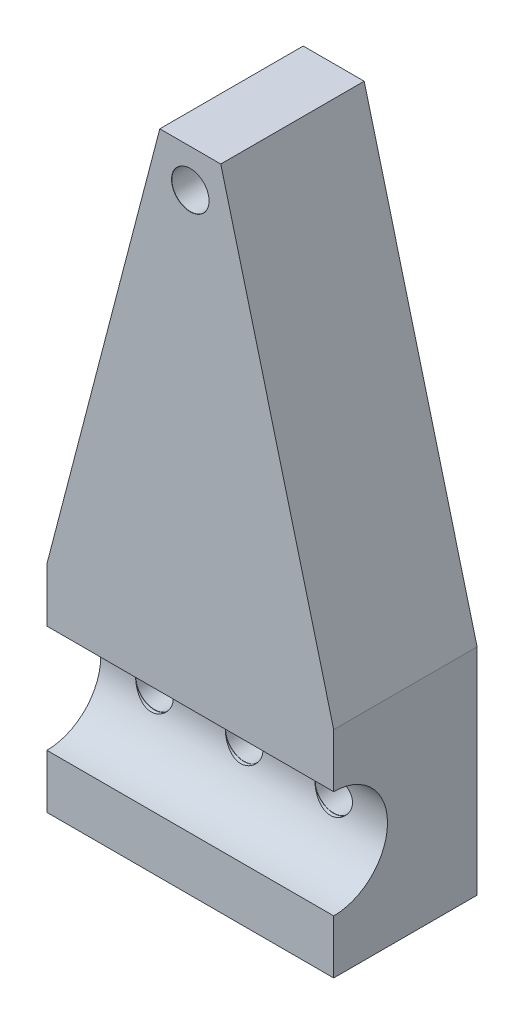
ISO-10303-21;
HEADER;
FILE_DESCRIPTION(('STEP AP214'),'2;1');
FILE_NAME('part.step','',(''),(''),'','','');
FILE_SCHEMA(('AUTOMOTIVE_DESIGN { 1 0 10303 214 1 1 1 1 }'));
ENDSEC;
DATA;
#1=APPLICATION_CONTEXT('core data for automotive mechanical design processes');
#2=APPLICATION_PROTOCOL_DEFINITION('international standard','automotive_design',2000,#1);
#3=PRODUCT_CONTEXT('',#1,'mechanical');
#4=PRODUCT('Part','Part','',(#3));
#5=PRODUCT_RELATED_PRODUCT_CATEGORY('part','',(#4));
#6=PRODUCT_DEFINITION_FORMATION('','',#4);
#7=PRODUCT_DEFINITION_CONTEXT('part definition',#1,'design');
#8=PRODUCT_DEFINITION('design','',#6,#7);
#9=PRODUCT_DEFINITION_SHAPE('','',#8);
#10=(LENGTH_UNIT() NAMED_UNIT(*) SI_UNIT(.MILLI.,.METRE.));
#11=(NAMED_UNIT(*) PLANE_ANGLE_UNIT() SI_UNIT($,.RADIAN.));
#12=(NAMED_UNIT(*) SI_UNIT($,.STERADIAN.) SOLID_ANGLE_UNIT());
#13=UNCERTAINTY_MEASURE_WITH_UNIT(LENGTH_MEASURE(1.E-05),#10,'distance_accuracy_value','');
#14=(GEOMETRIC_REPRESENTATION_CONTEXT(3) GLOBAL_UNCERTAINTY_ASSIGNED_CONTEXT((#13)) GLOBAL_UNIT_ASSIGNED_CONTEXT((#10,
#11,#12)) REPRESENTATION_CONTEXT('',''));
#15=CARTESIAN_POINT('',(0.,0.,0.));
#16=DIRECTION('',(0.,0.,1.));
#17=DIRECTION('',(1.,0.,0.));
#18=AXIS2_PLACEMENT_3D('',#15,#16,#17);
#19=CARTESIAN_POINT('',(-25.4,0.,25.4));
#20=DIRECTION('',(-1.,0.,0.));
#21=DIRECTION('',(0.,0.,1.));
#22=AXIS2_PLACEMENT_3D('',#19,#20,#21);
#23=PLANE('',#22);
#24=DIRECTION('',(0.,1.,0.));
#25=VECTOR('',#24,1.);
#26=CARTESIAN_POINT('',(-25.4,0.,25.4));
#27=LINE('',#26,#25);
#28=CARTESIAN_POINT('',(-25.4,-19.05,25.4));
#29=VERTEX_POINT('',#28);
#30=CARTESIAN_POINT('',(-25.4,-9.52500000000001,25.4));
#31=VERTEX_POINT('',#30);
#32=EDGE_CURVE('E246',#29,#31,#27,.T.);
#33=ORIENTED_EDGE('',*,*,#32,.T.);
#34=CARTESIAN_POINT('',(-25.4,0.,25.4));
#35=DIRECTION('',(-1.,0.,0.));
#36=DIRECTION('',(0.,0.,1.));
#37=AXIS2_PLACEMENT_3D('',#34,#35,#36);
#38=CIRCLE('',#37,9.525);
#39=CARTESIAN_POINT('',(-25.4,9.52499999999999,25.4));
#40=VERTEX_POINT('',#39);
#41=EDGE_CURVE('E237',#31,#40,#38,.F.);
#42=ORIENTED_EDGE('',*,*,#41,.T.);
#43=CARTESIAN_POINT('',(-25.4,19.05,25.4));
#44=VERTEX_POINT('',#43);
#45=EDGE_CURVE('E244',#40,#44,#27,.T.);
#46=ORIENTED_EDGE('',*,*,#45,.T.);
#47=DIRECTION('',(0.,0.,-1.));
#48=VECTOR('',#47,1.);
#49=CARTESIAN_POINT('',(-25.4,19.05,25.4));
#50=LINE('',#49,#48);
#51=CARTESIAN_POINT('',(-25.4,19.05,0.));
#52=VERTEX_POINT('',#51);
#53=EDGE_CURVE('E231',#44,#52,#50,.T.);
#54=ORIENTED_EDGE('',*,*,#53,.T.);
#55=DIRECTION('',(0.,1.,0.));
#56=VECTOR('',#55,1.);
#57=CARTESIAN_POINT('',(-25.4,0.,0.));
#58=LINE('',#57,#56);
#59=CARTESIAN_POINT('',(-25.4,-19.05,0.));
#60=VERTEX_POINT('',#59);
#61=EDGE_CURVE('E212',#60,#52,#58,.T.);
#62=ORIENTED_EDGE('',*,*,#61,.F.);
#63=DIRECTION('',(0.,0.,-1.));
#64=VECTOR('',#63,1.);
#65=CARTESIAN_POINT('',(-25.4,-19.05,25.4));
#66=LINE('',#65,#64);
#67=EDGE_CURVE('E229',#29,#60,#66,.T.);
#68=ORIENTED_EDGE('',*,*,#67,.F.);
#69=EDGE_LOOP('',(#33,#42,#46,#54,#62,#68));
#70=FACE_BOUND('',#69,.T.);
#71=ADVANCED_FACE('F47',(#70),#23,.T.);
#72=CARTESIAN_POINT('',(25.4,0.,25.4));
#73=DIRECTION('',(-1.,0.,0.));
#74=DIRECTION('',(0.,0.,1.));
#75=AXIS2_PLACEMENT_3D('',#72,#73,#74);
#76=PLANE('',#75);
#77=CARTESIAN_POINT('',(25.4,0.,25.4));
#78=DIRECTION('',(-1.,0.,0.));
#79=DIRECTION('',(0.,0.,1.));
#80=AXIS2_PLACEMENT_3D('',#77,#78,#79);
#81=CIRCLE('',#80,9.525);
#82=CARTESIAN_POINT('',(25.4,-9.525,25.4));
#83=VERTEX_POINT('',#82);
#84=CARTESIAN_POINT('',(25.4,9.52499999999999,25.4));
#85=VERTEX_POINT('',#84);
#86=EDGE_CURVE('E240',#83,#85,#81,.F.);
#87=ORIENTED_EDGE('',*,*,#86,.F.);
#88=DIRECTION('',(0.,1.,0.));
#89=VECTOR('',#88,1.);
#90=CARTESIAN_POINT('',(25.4,0.,25.4));
#91=LINE('',#90,#89);
#92=CARTESIAN_POINT('',(25.4,-19.05,25.4));
#93=VERTEX_POINT('',#92);
#94=EDGE_CURVE('E227',#93,#83,#91,.T.);
#95=ORIENTED_EDGE('',*,*,#94,.F.);
#96=DIRECTION('',(0.,0.,-1.));
#97=VECTOR('',#96,1.);
#98=CARTESIAN_POINT('',(25.4,-19.05,25.4));
#99=LINE('',#98,#97);
#100=CARTESIAN_POINT('',(25.4,-19.05,0.));
#101=VERTEX_POINT('',#100);
#102=EDGE_CURVE('E226',#93,#101,#99,.T.);
#103=ORIENTED_EDGE('',*,*,#102,.T.);
#104=DIRECTION('',(0.,1.,0.));
#105=VECTOR('',#104,1.);
#106=CARTESIAN_POINT('',(25.4,0.,0.));
#107=LINE('',#106,#105);
#108=CARTESIAN_POINT('',(25.4,19.05,0.));
#109=VERTEX_POINT('',#108);
#110=EDGE_CURVE('E220',#101,#109,#107,.T.);
#111=ORIENTED_EDGE('',*,*,#110,.T.);
#112=DIRECTION('',(0.,0.,-1.));
#113=VECTOR('',#112,1.);
#114=CARTESIAN_POINT('',(25.4,19.05,25.4));
#115=LINE('',#114,#113);
#116=CARTESIAN_POINT('',(25.4,19.05,25.4));
#117=VERTEX_POINT('',#116);
#118=EDGE_CURVE('E224',#117,#109,#115,.T.);
#119=ORIENTED_EDGE('',*,*,#118,.F.);
#120=EDGE_CURVE('E261',#85,#117,#91,.T.);
#121=ORIENTED_EDGE('',*,*,#120,.F.);
#122=EDGE_LOOP('',(#87,#95,#103,#111,#119,#121));
#123=FACE_BOUND('',#122,.T.);
#124=ADVANCED_FACE('F169',(#123),#76,.F.);
#125=CARTESIAN_POINT('',(0.,0.,25.4));
#126=DIRECTION('',(0.,0.,1.));
#127=DIRECTION('',(1.,0.,0.));
#128=AXIS2_PLACEMENT_3D('',#125,#126,#127);
#129=PLANE('',#128);
#130=DIRECTION('',(1.,0.,0.));
#131=VECTOR('',#130,1.);
#132=CARTESIAN_POINT('',(-30.4,-9.52500000000001,25.4));
#133=LINE('',#132,#131);
#134=EDGE_CURVE('E12',#31,#83,#133,.T.);
#135=ORIENTED_EDGE('',*,*,#134,.F.);
#136=ORIENTED_EDGE('',*,*,#32,.F.);
#137=DIRECTION('',(-1.,0.,0.));
#138=VECTOR('',#137,1.);
#139=CARTESIAN_POINT('',(0.,-19.05,25.4));
#140=LINE('',#139,#138);
#141=EDGE_CURVE('E254',#93,#29,#140,.T.);
#142=ORIENTED_EDGE('',*,*,#141,.F.);
#143=ORIENTED_EDGE('',*,*,#94,.T.);
#144=EDGE_LOOP('',(#135,#136,#142,#143));
#145=FACE_BOUND('',#144,.T.);
#146=ADVANCED_FACE('F176',(#145),#129,.T.);
#147=CARTESIAN_POINT('',(28.4333962760668,7.40937559565797,25.4));
#148=DIRECTION('',(0.96768400620087,0.252165945644995,0.));
#149=DIRECTION('',(-0.252165945644995,0.96768400620087,0.));
#150=AXIS2_PLACEMENT_3D('',#147,#148,#149);
#151=PLANE('',#150);
#152=DIRECTION('',(0.252165945644995,-0.96768400620087,0.));
#153=VECTOR('',#152,1.);
#154=CARTESIAN_POINT('',(28.4333962760668,7.40937559565797,0.));
#155=LINE('',#154,#153);
#156=CARTESIAN_POINT('',(5.39965378389645,95.8011057145303,0.));
#157=VERTEX_POINT('',#156);
#158=EDGE_CURVE('E205',#157,#109,#155,.T.);
#159=ORIENTED_EDGE('',*,*,#158,.F.);
#160=DIRECTION('',(0.,0.,-1.));
#161=VECTOR('',#160,1.);
#162=CARTESIAN_POINT('',(5.39965378389645,95.8011057145303,25.4));
#163=LINE('',#162,#161);
#164=CARTESIAN_POINT('',(5.39965378389645,95.8011057145303,25.4));
#165=VERTEX_POINT('',#164);
#166=EDGE_CURVE('E200',#165,#157,#163,.T.);
#167=ORIENTED_EDGE('',*,*,#166,.F.);
#168=DIRECTION('',(0.252165945644995,-0.96768400620087,0.));
#169=VECTOR('',#168,1.);
#170=CARTESIAN_POINT('',(28.4333962760668,7.40937559565797,25.4));
#171=LINE('',#170,#169);
#172=EDGE_CURVE('E223',#165,#117,#171,.T.);
#173=ORIENTED_EDGE('',*,*,#172,.T.);
#174=ORIENTED_EDGE('',*,*,#118,.T.);
#175=EDGE_LOOP('',(#159,#167,#173,#174));
#176=FACE_BOUND('',#175,.T.);
#177=ADVANCED_FACE('F49',(#176),#151,.T.);
#178=CARTESIAN_POINT('',(0.,95.8011057145303,25.4));
#179=DIRECTION('',(0.,1.,0.));
#180=DIRECTION('',(0.,0.,1.));
#181=AXIS2_PLACEMENT_3D('',#178,#179,#180);
#182=PLANE('',#181);
#183=DIRECTION('',(1.,0.,0.));
#184=VECTOR('',#183,1.);
#185=CARTESIAN_POINT('',(0.,95.8011057145303,0.));
#186=LINE('',#185,#184);
#187=CARTESIAN_POINT('',(-5.39965378389645,95.8011057145303,0.));
#188=VERTEX_POINT('',#187);
#189=EDGE_CURVE('E195',#188,#157,#186,.T.);
#190=ORIENTED_EDGE('',*,*,#189,.F.);
#191=DIRECTION('',(0.,0.,-1.));
#192=VECTOR('',#191,1.);
#193=CARTESIAN_POINT('',(-5.39965378389645,95.8011057145303,25.4));
#194=LINE('',#193,#192);
#195=CARTESIAN_POINT('',(-5.39965378389645,95.8011057145303,25.4));
#196=VERTEX_POINT('',#195);
#197=EDGE_CURVE('E198',#196,#188,#194,.T.);
#198=ORIENTED_EDGE('',*,*,#197,.F.);
#199=DIRECTION('',(1.,0.,0.));
#200=VECTOR('',#199,1.);
#201=CARTESIAN_POINT('',(0.,95.8011057145303,25.4));
#202=LINE('',#201,#200);
#203=EDGE_CURVE('E255',#196,#165,#202,.T.);
#204=ORIENTED_EDGE('',*,*,#203,.T.);
#205=ORIENTED_EDGE('',*,*,#166,.T.);
#206=EDGE_LOOP('',(#190,#198,#204,#205));
#207=FACE_BOUND('',#206,.T.);
#208=ADVANCED_FACE('F185',(#207),#182,.T.);
#209=CARTESIAN_POINT('',(-28.4333962760668,7.40937559565796,25.4));
#210=DIRECTION('',(-0.96768400620087,0.252165945644995,0.));
#211=DIRECTION('',(-0.252165945644995,-0.96768400620087,0.));
#212=AXIS2_PLACEMENT_3D('',#209,#210,#211);
#213=PLANE('',#212);
#214=DIRECTION('',(0.252165945644995,0.96768400620087,0.));
#215=VECTOR('',#214,1.);
#216=CARTESIAN_POINT('',(-28.4333962760668,7.40937559565796,0.));
#217=LINE('',#216,#215);
#218=EDGE_CURVE('E204',#52,#188,#217,.T.);
#219=ORIENTED_EDGE('',*,*,#218,.F.);
#220=ORIENTED_EDGE('',*,*,#53,.F.);
#221=DIRECTION('',(0.252165945644995,0.96768400620087,0.));
#222=VECTOR('',#221,1.);
#223=CARTESIAN_POINT('',(-28.4333962760668,7.40937559565796,25.4));
#224=LINE('',#223,#222);
#225=EDGE_CURVE('E252',#44,#196,#224,.T.);
#226=ORIENTED_EDGE('',*,*,#225,.T.);
#227=ORIENTED_EDGE('',*,*,#197,.T.);
#228=EDGE_LOOP('',(#219,#220,#226,#227));
#229=FACE_BOUND('',#228,.T.);
#230=ADVANCED_FACE('F183',(#229),#213,.T.);
#231=CARTESIAN_POINT('',(0.,-19.05,25.4));
#232=DIRECTION('',(0.,-1.,0.));
#233=DIRECTION('',(1.,0.,0.));
#234=AXIS2_PLACEMENT_3D('',#231,#232,#233);
#235=PLANE('',#234);
#236=DIRECTION('',(-1.,0.,0.));
#237=VECTOR('',#236,1.);
#238=CARTESIAN_POINT('',(0.,-19.05,0.));
#239=LINE('',#238,#237);
#240=EDGE_CURVE('E215',#101,#60,#239,.T.);
#241=ORIENTED_EDGE('',*,*,#240,.F.);
#242=ORIENTED_EDGE('',*,*,#102,.F.);
#243=ORIENTED_EDGE('',*,*,#141,.T.);
#244=ORIENTED_EDGE('',*,*,#67,.T.);
#245=EDGE_LOOP('',(#241,#242,#243,#244));
#246=FACE_BOUND('',#245,.T.);
#247=ADVANCED_FACE('F182',(#246),#235,.T.);
#248=CARTESIAN_POINT('',(0.,89.0924449527195,25.4));
#249=DIRECTION('',(0.,0.,1.));
#250=DIRECTION('',(1.,0.,0.));
#251=AXIS2_PLACEMENT_3D('',#248,#249,#250);
#252=CIRCLE('',#251,3.325);
#253=CARTESIAN_POINT('',(3.325,89.0924449527195,25.4));
#254=VERTEX_POINT('',#253);
#255=EDGE_CURVE('E289',#254,#254,#252,.T.);
#256=ORIENTED_EDGE('',*,*,#255,.F.);
#257=EDGE_LOOP('',(#256));
#258=FACE_BOUND('',#257,.T.);
#259=DIRECTION('',(1.,0.,0.));
#260=VECTOR('',#259,1.);
#261=CARTESIAN_POINT('',(-30.4,9.52499999999999,25.4));
#262=LINE('',#261,#260);
#263=EDGE_CURVE('E55',#85,#40,#262,.F.);
#264=ORIENTED_EDGE('',*,*,#263,.F.);
#265=ORIENTED_EDGE('',*,*,#120,.T.);
#266=ORIENTED_EDGE('',*,*,#172,.F.);
#267=ORIENTED_EDGE('',*,*,#203,.F.);
#268=ORIENTED_EDGE('',*,*,#225,.F.);
#269=ORIENTED_EDGE('',*,*,#45,.F.);
#270=EDGE_LOOP('',(#264,#265,#266,#267,#268,#269));
#271=FACE_BOUND('',#270,.T.);
#272=ADVANCED_FACE('F250',(#258,#271),#129,.T.);
#273=CARTESIAN_POINT('',(0.,0.,0.));
#274=DIRECTION('',(0.,0.,1.));
#275=DIRECTION('',(1.,0.,0.));
#276=AXIS2_PLACEMENT_3D('',#273,#274,#275);
#277=PLANE('',#276);
#278=CARTESIAN_POINT('',(0.,0.,0.));
#279=DIRECTION('',(0.,0.,1.));
#280=DIRECTION('',(0.,-1.,0.));
#281=AXIS2_PLACEMENT_3D('',#278,#279,#280);
#282=CIRCLE('',#281,3.3);
#283=CARTESIAN_POINT('',(0.,-3.29999999999998,0.));
#284=VERTEX_POINT('',#283);
#285=EDGE_CURVE('E132',#284,#284,#282,.T.);
#286=ORIENTED_EDGE('',*,*,#285,.T.);
#287=EDGE_LOOP('',(#286));
#288=FACE_BOUND('',#287,.T.);
#289=CARTESIAN_POINT('',(-15.875,0.,0.));
#290=DIRECTION('',(0.,0.,1.));
#291=DIRECTION('',(0.,-1.,0.));
#292=AXIS2_PLACEMENT_3D('',#289,#290,#291);
#293=CIRCLE('',#292,3.3);
#294=CARTESIAN_POINT('',(-15.875,-3.29999999999998,0.));
#295=VERTEX_POINT('',#294);
#296=EDGE_CURVE('E473',#295,#295,#293,.T.);
#297=ORIENTED_EDGE('',*,*,#296,.T.);
#298=EDGE_LOOP('',(#297));
#299=FACE_BOUND('',#298,.T.);
#300=CARTESIAN_POINT('',(15.875,0.,0.));
#301=DIRECTION('',(0.,0.,1.));
#302=DIRECTION('',(0.,-1.,0.));
#303=AXIS2_PLACEMENT_3D('',#300,#301,#302);
#304=CIRCLE('',#303,3.29999999999999);
#305=CARTESIAN_POINT('',(15.875,-3.29999999999998,0.));
#306=VERTEX_POINT('',#305);
#307=EDGE_CURVE('E459',#306,#306,#304,.T.);
#308=ORIENTED_EDGE('',*,*,#307,.T.);
#309=EDGE_LOOP('',(#308));
#310=FACE_BOUND('',#309,.T.);
#311=CARTESIAN_POINT('',(0.,89.0924449527195,0.));
#312=DIRECTION('',(0.,0.,1.));
#313=DIRECTION('',(1.,0.,0.));
#314=AXIS2_PLACEMENT_3D('',#311,#312,#313);
#315=CIRCLE('',#314,3.3);
#316=CARTESIAN_POINT('',(3.3,89.0924449527195,0.));
#317=VERTEX_POINT('',#316);
#318=EDGE_CURVE('E247',#317,#317,#315,.T.);
#319=ORIENTED_EDGE('',*,*,#318,.T.);
#320=EDGE_LOOP('',(#319));
#321=FACE_BOUND('',#320,.T.);
#322=ORIENTED_EDGE('',*,*,#158,.T.);
#323=ORIENTED_EDGE('',*,*,#110,.F.);
#324=ORIENTED_EDGE('',*,*,#240,.T.);
#325=ORIENTED_EDGE('',*,*,#61,.T.);
#326=ORIENTED_EDGE('',*,*,#218,.T.);
#327=ORIENTED_EDGE('',*,*,#189,.T.);
#328=EDGE_LOOP('',(#322,#323,#324,#325,#326,#327));
#329=FACE_BOUND('',#328,.T.);
#330=ADVANCED_FACE('F209',(#288,#299,#310,#321,#329),#277,.F.);
#331=CARTESIAN_POINT('',(-30.4,0.,25.4));
#332=DIRECTION('',(1.,0.,0.));
#333=DIRECTION('',(0.,1.,0.));
#334=AXIS2_PLACEMENT_3D('',#331,#332,#333);
#335=CYLINDRICAL_SURFACE('',#334,9.525);
#336=CARTESIAN_POINT('',(3.325,0.,15.875));
#337=CARTESIAN_POINT('',(3.32500269177788,-0.180927886540019,15.8749981181154));
#338=CARTESIAN_POINT('',(3.31018494433519,-0.361836565163814,15.8802016899135));
#339=CARTESIAN_POINT('',(3.25150794893367,-0.718296007582611,15.9004446505123));
#340=CARTESIAN_POINT('',(3.20764841204943,-0.893846718055107,15.9154841371666));
#341=CARTESIAN_POINT('',(3.092594954062,-1.2343998782923,15.953771915604));
#342=CARTESIAN_POINT('',(3.02144934443458,-1.3994203734488,15.9770056931368));
#343=CARTESIAN_POINT('',(2.85407172098198,-1.71518268607094,16.0293318697378));
#344=CARTESIAN_POINT('',(2.75783404494306,-1.86592127023493,16.0584255908089));
#345=CARTESIAN_POINT('',(2.5392164390047,-2.15450066147796,16.1206524959264));
#346=CARTESIAN_POINT('',(2.4160618906127,-2.2917321891639,16.1538890768646));
#347=CARTESIAN_POINT('',(2.1487520813847,-2.54406902747633,16.2201095497923));
#348=CARTESIAN_POINT('',(2.00459159181076,-2.65916881253863,16.2530933767091));
#349=CARTESIAN_POINT('',(1.69370720388528,-2.8675951528428,16.3162348340098));
#350=CARTESIAN_POINT('',(1.52640784596148,-2.96010480396657,16.3462678611302));
#351=CARTESIAN_POINT('',(1.1774086521571,-3.1154096899305,16.3985217094727));
#352=CARTESIAN_POINT('',(0.995713724465665,-3.17821500203773,16.4207451794471));
#353=CARTESIAN_POINT('',(0.630045097814761,-3.26999852034723,16.453768946574));
#354=CARTESIAN_POINT('',(0.446396080838094,-3.30012669649354,16.4649562313877));
#355=CARTESIAN_POINT('',(0.0763348618301902,-3.32929653477738,16.4757815328895));
#356=CARTESIAN_POINT('',(-0.110076363913892,-3.32834893031762,16.4754235372544));
#357=CARTESIAN_POINT('',(-0.470313085663508,-3.2962819343437,16.4635358816454));
#358=CARTESIAN_POINT('',(-0.644297180541109,-3.26669626446035,16.4525741289399));
#359=CARTESIAN_POINT('',(-0.984656041030218,-3.18070719773596,16.4216486608529));
#360=CARTESIAN_POINT('',(-1.15102980909656,-3.12430029620521,16.4016837690625));
#361=CARTESIAN_POINT('',(-1.47479736181408,-2.98532662091524,16.3546203951965));
#362=CARTESIAN_POINT('',(-1.63198740963477,-2.90232648413167,16.3274050949932));
#363=CARTESIAN_POINT('',(-1.93067883925261,-2.71282348818773,16.2689526656893));
#364=CARTESIAN_POINT('',(-2.07217532762189,-2.60631332912104,16.2377142886735));
#365=CARTESIAN_POINT('',(-2.34403637929452,-2.36557529407886,16.172536701332));
#366=CARTESIAN_POINT('',(-2.47328984467824,-2.23010400072464,16.1385455791034));
#367=CARTESIAN_POINT('',(-2.70754875444862,-1.93899799014072,16.0732568594393));
#368=CARTESIAN_POINT('',(-2.81255140110428,-1.78336094969019,16.0419595730432));
#369=CARTESIAN_POINT('',(-2.99633987901323,-1.45381167080781,15.9851020227686));
#370=CARTESIAN_POINT('',(-3.07480175744895,-1.27970546926015,15.9596138076835));
#371=CARTESIAN_POINT('',(-3.20096884767642,-0.919658833769965,15.9177728231044));
#372=CARTESIAN_POINT('',(-3.24868582407266,-0.733722956439573,15.9014165595691));
#373=CARTESIAN_POINT('',(-3.30997931578551,-0.364681311600993,15.8802742073924));
#374=CARTESIAN_POINT('',(-3.32505523155,-0.181853362837723,15.8749803819676));
#375=CARTESIAN_POINT('',(-3.32494449182676,0.183772843083712,15.8750197145331));
#376=CARTESIAN_POINT('',(-3.30976351159849,0.366571099379508,15.8803508796033));
#377=CARTESIAN_POINT('',(-3.25074062617003,0.720773821851788,15.9007056096004));
#378=CARTESIAN_POINT('',(-3.20784155757056,0.892355578023737,15.9154101246152));
#379=CARTESIAN_POINT('',(-3.09580178597797,1.22579942118642,15.9527141254993));
#380=CARTESIAN_POINT('',(-3.02665768938929,1.38766024808281,15.9753146323246));
#381=CARTESIAN_POINT('',(-2.86198984574268,1.70205719525428,16.0269151258067));
#382=CARTESIAN_POINT('',(-2.7657906094408,1.85421258808097,16.0560745406908));
#383=CARTESIAN_POINT('',(-2.55052487839132,2.14069537677284,16.1175138248302));
#384=CARTESIAN_POINT('',(-2.4314508238442,2.27501685389701,16.1497947239349));
#385=CARTESIAN_POINT('',(-2.16677873954134,2.52902979366398,16.2158981647271));
#386=CARTESIAN_POINT('',(-2.02015137751413,2.64765237903986,16.2497169916967));
#387=CARTESIAN_POINT('',(-1.70836279015576,2.85876951736255,16.3134571358643));
#388=CARTESIAN_POINT('',(-1.54320094563822,2.95126319705075,16.3433783227807));
#389=CARTESIAN_POINT('',(-1.19854986279588,3.10722692084172,16.3956915383019));
#390=CARTESIAN_POINT('',(-1.01906215516933,3.17070006088498,16.4180843699719));
#391=CARTESIAN_POINT('',(-0.650968379666502,3.26618568093222,16.4523589736492));
#392=CARTESIAN_POINT('',(-0.462367009063259,3.29821419012142,16.4642461007259));
#393=CARTESIAN_POINT('',(-0.0928034725757218,3.32857982042956,16.4755158448749));
#394=CARTESIAN_POINT('',(0.0879927086048065,3.32870839799607,16.4755633590752));
#395=CARTESIAN_POINT('',(0.446883839589189,3.29974595268097,16.4648147826168));
#396=CARTESIAN_POINT('',(0.624978980572901,3.2706570077084,16.4540194630852));
#397=CARTESIAN_POINT('',(0.969324999293775,3.18540298790269,16.4233191206398));
#398=CARTESIAN_POINT('',(1.13575362916829,3.12987254444573,16.4036281457709));
#399=CARTESIAN_POINT('',(1.45705082643739,2.99384079496226,16.3574518493609));
#400=CARTESIAN_POINT('',(1.61191667096609,2.91333363015078,16.3309649339498));
#401=CARTESIAN_POINT('',(1.91359361956794,2.7252250427327,16.272629544645));
#402=CARTESIAN_POINT('',(2.05968358482258,2.61652762683642,16.2405875277619));
#403=CARTESIAN_POINT('',(2.3321264701041,2.37691852297498,16.1755065886171));
#404=CARTESIAN_POINT('',(2.45847353565305,2.24600026965339,16.1424673741029));
#405=CARTESIAN_POINT('',(2.69351066055604,1.95871399341554,16.0773572976596));
#406=CARTESIAN_POINT('',(2.80117075906712,1.80147556719491,16.0453941459572));
#407=CARTESIAN_POINT('',(2.98844225240492,1.47005025149398,15.9876237089698));
#408=CARTESIAN_POINT('',(3.06805756187093,1.29586573177381,15.9618155646988));
#409=CARTESIAN_POINT('',(3.19562776113151,0.93768580378341,15.9195757741975));
#410=CARTESIAN_POINT('',(3.24397367903628,0.753843944646918,15.9030286847162));
#411=CARTESIAN_POINT('',(3.30865282194494,0.379992885961871,15.8807436640996));
#412=CARTESIAN_POINT('',(3.32499717346105,0.189985853327078,15.8750019760993));
#413=CARTESIAN_POINT('',(3.325,0.,15.875));
#414=B_SPLINE_CURVE_WITH_KNOTS('',3,(#336,#337,#338,#339,#340,#341,#342,#343,#344,#345,#346,
#347,#348,#349,#350,#351,#352,#353,#354,#355,#356,#357,#358,#359,#360,#361,#362,#363,#364,#365,
#366,#367,#368,#369,#370,#371,#372,#373,#374,#375,#376,#377,#378,#379,#380,#381,#382,#383,#384,
#385,#386,#387,#388,#389,#390,#391,#392,#393,#394,#395,#396,#397,#398,#399,#400,#401,#402,#403,
#404,#405,#406,#407,#408,#409,#410,#411,#412,#413),.UNSPECIFIED.,.T.,.F.,(4,2,2,2,2,2,2,2,2,2,2,
2,2,2,2,2,2,2,2,2,2,2,2,2,2,2,2,2,2,2,2,2,2,2,2,2,2,2,4),(0.,0.542083902588746,1.0841731982393,
1.62530709349149,2.1665632055265,2.72614013357338,3.28585658858578,3.86352810782444,
4.44100350981462,4.99742173500784,5.55364777844903,6.08164419569958,6.60970962440967,
7.14685997279776,7.68417734259077,8.25245296020779,8.82079410505654,9.39584115702675,
9.97066803508929,10.5184740649625,11.0661773530087,11.5961667181282,12.126224636522,
12.6709140821693,13.2157838505174,13.7879276383818,14.3600905456996,14.9321923998498,
15.5040024682427,16.0436927616874,16.5833446758364,17.1106512230214,17.6380815540472,
18.1903120104623,18.7427059135181,19.3195670489148,19.8963476310602,20.4657684164953,
21.034991186836),.UNSPECIFIED.);
#415=CARTESIAN_POINT('',(3.325,0.,15.875));
#416=VERTEX_POINT('',#415);
#417=CARTESIAN_POINT('',(-3.325,0.,15.875));
#418=VERTEX_POINT('',#417);
#419=EDGE_CURVE('E135',#416,#418,#414,.T.);
#420=ORIENTED_EDGE('',*,*,#419,.T.);
#421=EDGE_CURVE('E131',#418,#416,#414,.T.);
#422=ORIENTED_EDGE('',*,*,#421,.T.);
#423=EDGE_LOOP('',(#420,#422));
#424=FACE_BOUND('',#423,.T.);
#425=CARTESIAN_POINT('',(-12.55,0.,15.875));
#426=CARTESIAN_POINT('',(-12.5499973082221,-0.180927886540021,15.8749981181154));
#427=CARTESIAN_POINT('',(-12.5648150556648,-0.361836565163816,15.8802016899135));
#428=CARTESIAN_POINT('',(-12.6234920510663,-0.718296007582613,15.9004446505123));
#429=CARTESIAN_POINT('',(-12.6673515879506,-0.893846718055109,15.9154841371666));
#430=CARTESIAN_POINT('',(-12.782405045938,-1.2343998782923,15.953771915604));
#431=CARTESIAN_POINT('',(-12.8535506555654,-1.3994203734488,15.9770056931368));
#432=CARTESIAN_POINT('',(-13.020928279018,-1.71518268607094,16.0293318697378));
#433=CARTESIAN_POINT('',(-13.1171659550569,-1.86592127023494,16.0584255908089));
#434=CARTESIAN_POINT('',(-13.3357835609953,-2.15450066147796,16.1206524959264));
#435=CARTESIAN_POINT('',(-13.4589381093873,-2.2917321891639,16.1538890768646));
#436=CARTESIAN_POINT('',(-13.7262479186153,-2.54406902747633,16.2201095497923));
#437=CARTESIAN_POINT('',(-13.8704084081892,-2.65916881253863,16.2530933767091));
#438=CARTESIAN_POINT('',(-14.1812927961147,-2.8675951528428,16.3162348340098));
#439=CARTESIAN_POINT('',(-14.3485921540385,-2.96010480396657,16.3462678611302));
#440=CARTESIAN_POINT('',(-14.6975913478429,-3.11540968993051,16.3985217094727));
#441=CARTESIAN_POINT('',(-14.8792862755343,-3.17821500203773,16.4207451794471));
#442=CARTESIAN_POINT('',(-15.2449549021852,-3.26999852034723,16.453768946574));
#443=CARTESIAN_POINT('',(-15.4286039191619,-3.30012669649354,16.4649562313877));
#444=CARTESIAN_POINT('',(-15.7986651381698,-3.32929653477738,16.4757815328895));
#445=CARTESIAN_POINT('',(-15.9850763639139,-3.32834893031762,16.4754235372544));
#446=CARTESIAN_POINT('',(-16.3453130856635,-3.2962819343437,16.4635358816454));
#447=CARTESIAN_POINT('',(-16.5192971805411,-3.26669626446035,16.4525741289399));
#448=CARTESIAN_POINT('',(-16.8596560410302,-3.18070719773596,16.4216486608529));
#449=CARTESIAN_POINT('',(-17.0260298090966,-3.12430029620521,16.4016837690625));
#450=CARTESIAN_POINT('',(-17.3497973618141,-2.98532662091524,16.3546203951965));
#451=CARTESIAN_POINT('',(-17.5069874096348,-2.90232648413167,16.3274050949932));
#452=CARTESIAN_POINT('',(-17.8056788392526,-2.71282348818773,16.2689526656893));
#453=CARTESIAN_POINT('',(-17.9471753276219,-2.60631332912104,16.2377142886735));
#454=CARTESIAN_POINT('',(-18.2190363792945,-2.36557529407886,16.172536701332));
#455=CARTESIAN_POINT('',(-18.3482898446782,-2.23010400072464,16.1385455791034));
#456=CARTESIAN_POINT('',(-18.5825487544486,-1.93899799014072,16.0732568594393));
#457=CARTESIAN_POINT('',(-18.6875514011043,-1.78336094969019,16.0419595730432));
#458=CARTESIAN_POINT('',(-18.8713398790132,-1.45381167080781,15.9851020227686));
#459=CARTESIAN_POINT('',(-18.949801757449,-1.27970546926014,15.9596138076835));
#460=CARTESIAN_POINT('',(-19.0759688476764,-0.919658833769962,15.9177728231044));
#461=CARTESIAN_POINT('',(-19.1236858240727,-0.73372295643957,15.9014165595691));
#462=CARTESIAN_POINT('',(-19.1849793157855,-0.364681311600989,15.8802742073924));
#463=CARTESIAN_POINT('',(-19.20005523155,-0.181853362837718,15.8749803819676));
#464=CARTESIAN_POINT('',(-19.1999444918268,0.183772843083717,15.8750197145331));
#465=CARTESIAN_POINT('',(-19.1847635115985,0.366571099379511,15.8803508796033));
#466=CARTESIAN_POINT('',(-19.12574062617,0.720773821851791,15.9007056096004));
#467=CARTESIAN_POINT('',(-19.0828415575706,0.892355578023739,15.9154101246152));
#468=CARTESIAN_POINT('',(-18.970801785978,1.22579942118643,15.9527141254993));
#469=CARTESIAN_POINT('',(-18.9016576893893,1.38766024808281,15.9753146323246));
#470=CARTESIAN_POINT('',(-18.7369898457427,1.70205719525428,16.0269151258067));
#471=CARTESIAN_POINT('',(-18.6407906094408,1.85421258808097,16.0560745406908));
#472=CARTESIAN_POINT('',(-18.4255248783913,2.14069537677284,16.1175138248302));
#473=CARTESIAN_POINT('',(-18.3064508238442,2.27501685389701,16.1497947239349));
#474=CARTESIAN_POINT('',(-18.0417787395413,2.52902979366398,16.2158981647271));
#475=CARTESIAN_POINT('',(-17.8951513775141,2.64765237903986,16.2497169916967));
#476=CARTESIAN_POINT('',(-17.5833627901558,2.85876951736255,16.3134571358643));
#477=CARTESIAN_POINT('',(-17.4182009456382,2.95126319705075,16.3433783227807));
#478=CARTESIAN_POINT('',(-17.0735498627959,3.10722692084172,16.3956915383019));
#479=CARTESIAN_POINT('',(-16.8940621551693,3.17070006088498,16.4180843699719));
#480=CARTESIAN_POINT('',(-16.5259683796665,3.26618568093222,16.4523589736492));
#481=CARTESIAN_POINT('',(-16.3373670090633,3.29821419012142,16.4642461007259));
#482=CARTESIAN_POINT('',(-15.9678034725757,3.32857982042956,16.4755158448749));
#483=CARTESIAN_POINT('',(-15.7870072913952,3.32870839799607,16.4755633590752));
#484=CARTESIAN_POINT('',(-15.4281161604108,3.29974595268097,16.4648147826168));
#485=CARTESIAN_POINT('',(-15.2500210194271,3.2706570077084,16.4540194630853));
#486=CARTESIAN_POINT('',(-14.9056750007062,3.18540298790269,16.4233191206398));
#487=CARTESIAN_POINT('',(-14.7392463708317,3.12987254444573,16.4036281457709));
#488=CARTESIAN_POINT('',(-14.4179491735626,2.99384079496226,16.3574518493609));
#489=CARTESIAN_POINT('',(-14.2630833290339,2.91333363015078,16.3309649339498));
#490=CARTESIAN_POINT('',(-13.9614063804321,2.7252250427327,16.272629544645));
#491=CARTESIAN_POINT('',(-13.8153164151774,2.61652762683642,16.2405875277619));
#492=CARTESIAN_POINT('',(-13.5428735298959,2.37691852297498,16.1755065886171));
#493=CARTESIAN_POINT('',(-13.416526464347,2.24600026965339,16.1424673741029));
#494=CARTESIAN_POINT('',(-13.181489339444,1.95871399341554,16.0773572976596));
#495=CARTESIAN_POINT('',(-13.0738292409329,1.80147556719491,16.0453941459572));
#496=CARTESIAN_POINT('',(-12.8865577475951,1.47005025149398,15.9876237089698));
#497=CARTESIAN_POINT('',(-12.8069424381291,1.29586573177381,15.9618155646988));
#498=CARTESIAN_POINT('',(-12.6793722388685,0.937685803783407,15.9195757741975));
#499=CARTESIAN_POINT('',(-12.6310263209637,0.753843944646915,15.9030286847162));
#500=CARTESIAN_POINT('',(-12.5663471780551,0.379992885961869,15.8807436640996));
#501=CARTESIAN_POINT('',(-12.5500028265389,0.189985853327076,15.8750019760993));
#502=CARTESIAN_POINT('',(-12.55,0.,15.875));
#503=B_SPLINE_CURVE_WITH_KNOTS('',3,(#425,#426,#427,#428,#429,#430,#431,#432,#433,#434,#435,
#436,#437,#438,#439,#440,#441,#442,#443,#444,#445,#446,#447,#448,#449,#450,#451,#452,#453,#454,
#455,#456,#457,#458,#459,#460,#461,#462,#463,#464,#465,#466,#467,#468,#469,#470,#471,#472,#473,
#474,#475,#476,#477,#478,#479,#480,#481,#482,#483,#484,#485,#486,#487,#488,#489,#490,#491,#492,
#493,#494,#495,#496,#497,#498,#499,#500,#501,#502),.UNSPECIFIED.,.T.,.F.,(4,2,2,2,2,2,2,2,2,2,2,
2,2,2,2,2,2,2,2,2,2,2,2,2,2,2,2,2,2,2,2,2,2,2,2,2,2,2,4),(0.,0.542083902588747,1.0841731982393,
1.62530709349149,2.1665632055265,2.72614013357339,3.28585658858578,3.86352810782444,
4.44100350981462,4.99742173500783,5.55364777844902,6.08164419569958,6.60970962440967,
7.14685997279776,7.68417734259077,8.25245296020779,8.82079410505654,9.39584115702675,
9.97066803508929,10.5184740649625,11.0661773530087,11.5961667181282,12.126224636522,
12.6709140821693,13.2157838505174,13.7879276383818,14.3600905456996,14.9321923998498,
15.5040024682427,16.0436927616874,16.5833446758364,17.1106512230214,17.6380815540472,
18.1903120104624,18.7427059135181,19.3195670489148,19.8963476310602,20.4657684164954,
21.034991186836),.UNSPECIFIED.);
#504=CARTESIAN_POINT('',(-12.55,0.,15.875));
#505=VERTEX_POINT('',#504);
#506=CARTESIAN_POINT('',(-19.2,0.,15.875));
#507=VERTEX_POINT('',#506);
#508=EDGE_CURVE('E444',#505,#507,#503,.T.);
#509=ORIENTED_EDGE('',*,*,#508,.T.);
#510=EDGE_CURVE('E452',#507,#505,#503,.T.);
#511=ORIENTED_EDGE('',*,*,#510,.T.);
#512=EDGE_LOOP('',(#509,#511));
#513=FACE_BOUND('',#512,.T.);
#514=CARTESIAN_POINT('',(19.2,0.,15.875));
#515=CARTESIAN_POINT('',(19.2000026917779,-0.180927886540017,15.8749981181154));
#516=CARTESIAN_POINT('',(19.1851849443352,-0.361836565163812,15.8802016899135));
#517=CARTESIAN_POINT('',(19.1265079489337,-0.71829600758261,15.9004446505123));
#518=CARTESIAN_POINT('',(19.0826484120494,-0.893846718055105,15.9154841371666));
#519=CARTESIAN_POINT('',(18.967594954062,-1.2343998782923,15.953771915604));
#520=CARTESIAN_POINT('',(18.8964493444346,-1.3994203734488,15.9770056931368));
#521=CARTESIAN_POINT('',(18.729071720982,-1.71518268607094,16.0293318697378));
#522=CARTESIAN_POINT('',(18.6328340449431,-1.86592127023493,16.0584255908089));
#523=CARTESIAN_POINT('',(18.4142164390047,-2.15450066147796,16.1206524959264));
#524=CARTESIAN_POINT('',(18.2910618906127,-2.2917321891639,16.1538890768646));
#525=CARTESIAN_POINT('',(18.0237520813847,-2.54406902747633,16.2201095497923));
#526=CARTESIAN_POINT('',(17.8795915918108,-2.65916881253863,16.2530933767091));
#527=CARTESIAN_POINT('',(17.5687072038853,-2.86759515284279,16.3162348340098));
#528=CARTESIAN_POINT('',(17.4014078459615,-2.96010480396656,16.3462678611302));
#529=CARTESIAN_POINT('',(17.0524086521571,-3.1154096899305,16.3985217094727));
#530=CARTESIAN_POINT('',(16.8707137244657,-3.17821500203773,16.4207451794471));
#531=CARTESIAN_POINT('',(16.5050450978148,-3.26999852034723,16.453768946574));
#532=CARTESIAN_POINT('',(16.3213960808381,-3.30012669649354,16.4649562313877));
#533=CARTESIAN_POINT('',(15.9513348618302,-3.32929653477738,16.4757815328895));
#534=CARTESIAN_POINT('',(15.7649236360861,-3.32834893031761,16.4754235372544));
#535=CARTESIAN_POINT('',(15.4046869143365,-3.29628193434369,16.4635358816454));
#536=CARTESIAN_POINT('',(15.2307028194589,-3.26669626446035,16.4525741289399));
#537=CARTESIAN_POINT('',(14.8903439589698,-3.18070719773596,16.4216486608529));
#538=CARTESIAN_POINT('',(14.7239701909034,-3.1243002962052,16.4016837690625));
#539=CARTESIAN_POINT('',(14.4002026381859,-2.98532662091523,16.3546203951965));
#540=CARTESIAN_POINT('',(14.2430125903652,-2.90232648413167,16.3274050949932));
#541=CARTESIAN_POINT('',(13.9443211607474,-2.71282348818772,16.2689526656893));
#542=CARTESIAN_POINT('',(13.8028246723781,-2.60631332912104,16.2377142886735));
#543=CARTESIAN_POINT('',(13.5309636207055,-2.36557529407885,16.172536701332));
#544=CARTESIAN_POINT('',(13.4017101553218,-2.23010400072463,16.1385455791034));
#545=CARTESIAN_POINT('',(13.1674512455514,-1.93899799014071,16.0732568594393));
#546=CARTESIAN_POINT('',(13.0624485988957,-1.78336094969019,16.0419595730432));
#547=CARTESIAN_POINT('',(12.8786601209868,-1.4538116708078,15.9851020227686));
#548=CARTESIAN_POINT('',(12.800198242551,-1.27970546926014,15.9596138076835));
#549=CARTESIAN_POINT('',(12.6740311523236,-0.919658833769955,15.9177728231044));
#550=CARTESIAN_POINT('',(12.6263141759273,-0.733722956439563,15.9014165595691));
#551=CARTESIAN_POINT('',(12.5650206842145,-0.364681311600983,15.8802742073924));
#552=CARTESIAN_POINT('',(12.54994476845,-0.181853362837713,15.8749803819676));
#553=CARTESIAN_POINT('',(12.5500555081732,0.183772843083722,15.8750197145331));
#554=CARTESIAN_POINT('',(12.5652364884015,0.366571099379517,15.8803508796033));
#555=CARTESIAN_POINT('',(12.62425937383,0.720773821851798,15.9007056096004));
#556=CARTESIAN_POINT('',(12.6671584424294,0.892355578023747,15.9154101246152));
#557=CARTESIAN_POINT('',(12.779198214022,1.22579942118643,15.9527141254993));
#558=CARTESIAN_POINT('',(12.8483423106107,1.38766024808282,15.9753146323246));
#559=CARTESIAN_POINT('',(13.0130101542573,1.70205719525429,16.0269151258067));
#560=CARTESIAN_POINT('',(13.1092093905592,1.85421258808098,16.0560745406908));
#561=CARTESIAN_POINT('',(13.3244751216087,2.14069537677285,16.1175138248302));
#562=CARTESIAN_POINT('',(13.4435491761558,2.27501685389702,16.1497947239349));
#563=CARTESIAN_POINT('',(13.7082212604587,2.52902979366399,16.2158981647271));
#564=CARTESIAN_POINT('',(13.8548486224859,2.64765237903987,16.2497169916967));
#565=CARTESIAN_POINT('',(14.1666372098442,2.85876951736256,16.3134571358643));
#566=CARTESIAN_POINT('',(14.3317990543618,2.95126319705076,16.3433783227807));
#567=CARTESIAN_POINT('',(14.6764501372041,3.10722692084173,16.3956915383019));
#568=CARTESIAN_POINT('',(14.8559378448307,3.17070006088499,16.4180843699719));
#569=CARTESIAN_POINT('',(15.2240316203335,3.26618568093223,16.4523589736492));
#570=CARTESIAN_POINT('',(15.4126329909367,3.29821419012143,16.4642461007259));
#571=CARTESIAN_POINT('',(15.7821965274243,3.32857982042957,16.4755158448749));
#572=CARTESIAN_POINT('',(15.9629927086048,3.32870839799607,16.4755633590752));
#573=CARTESIAN_POINT('',(16.3218838395892,3.29974595268098,16.4648147826168));
#574=CARTESIAN_POINT('',(16.4999789805729,3.27065700770841,16.4540194630853));
#575=CARTESIAN_POINT('',(16.8443249992938,3.1854029879027,16.4233191206398));
#576=CARTESIAN_POINT('',(17.0107536291683,3.12987254444573,16.4036281457709));
#577=CARTESIAN_POINT('',(17.3320508264374,2.99384079496227,16.3574518493609));
#578=CARTESIAN_POINT('',(17.4869166709661,2.91333363015079,16.3309649339498));
#579=CARTESIAN_POINT('',(17.7885936195679,2.7252250427327,16.272629544645));
#580=CARTESIAN_POINT('',(17.9346835848226,2.61652762683642,16.2405875277619));
#581=CARTESIAN_POINT('',(18.2071264701041,2.37691852297498,16.1755065886171));
#582=CARTESIAN_POINT('',(18.3334735356531,2.24600026965339,16.1424673741029));
#583=CARTESIAN_POINT('',(18.568510660556,1.95871399341555,16.0773572976596));
#584=CARTESIAN_POINT('',(18.6761707590671,1.80147556719492,16.0453941459572));
#585=CARTESIAN_POINT('',(18.8634422524049,1.47005025149399,15.9876237089698));
#586=CARTESIAN_POINT('',(18.9430575618709,1.29586573177381,15.9618155646988));
#587=CARTESIAN_POINT('',(19.0706277611315,0.937685803783412,15.9195757741975));
#588=CARTESIAN_POINT('',(19.1189736790363,0.753843944646919,15.9030286847162));
#589=CARTESIAN_POINT('',(19.1836528219449,0.379992885961873,15.8807436640996));
#590=CARTESIAN_POINT('',(19.1999971734611,0.18998585332708,15.8750019760993));
#591=CARTESIAN_POINT('',(19.2,0.,15.875));
#592=B_SPLINE_CURVE_WITH_KNOTS('',3,(#514,#515,#516,#517,#518,#519,#520,#521,#522,#523,#524,
#525,#526,#527,#528,#529,#530,#531,#532,#533,#534,#535,#536,#537,#538,#539,#540,#541,#542,#543,
#544,#545,#546,#547,#548,#549,#550,#551,#552,#553,#554,#555,#556,#557,#558,#559,#560,#561,#562,
#563,#564,#565,#566,#567,#568,#569,#570,#571,#572,#573,#574,#575,#576,#577,#578,#579,#580,#581,
#582,#583,#584,#585,#586,#587,#588,#589,#590,#591),.UNSPECIFIED.,.T.,.F.,(4,2,2,2,2,2,2,2,2,2,2,
2,2,2,2,2,2,2,2,2,2,2,2,2,2,2,2,2,2,2,2,2,2,2,2,2,2,2,4),(0.,0.542083902588747,1.0841731982393,
1.62530709349149,2.1665632055265,2.72614013357339,3.28585658858578,3.86352810782444,
4.44100350981462,4.99742173500784,5.55364777844903,6.08164419569959,6.60970962440967,
7.14685997279776,7.68417734259078,8.2524529602078,8.82079410505654,9.39584115702676,
9.9706680350893,10.5184740649625,11.0661773530087,11.5961667181283,12.126224636522,
12.6709140821693,13.2157838505175,13.7879276383819,14.3600905456996,14.9321923998498,
15.5040024682427,16.0436927616874,16.5833446758364,17.1106512230214,17.6380815540472,
18.1903120104624,18.7427059135182,19.3195670489148,19.8963476310602,20.4657684164954,
21.034991186836),.UNSPECIFIED.);
#593=CARTESIAN_POINT('',(19.2,0.,15.875));
#594=VERTEX_POINT('',#593);
#595=CARTESIAN_POINT('',(12.55,0.,15.875));
#596=VERTEX_POINT('',#595);
#597=EDGE_CURVE('E292',#594,#596,#592,.T.);
#598=ORIENTED_EDGE('',*,*,#597,.T.);
#599=EDGE_CURVE('E297',#596,#594,#592,.T.);
#600=ORIENTED_EDGE('',*,*,#599,.T.);
#601=EDGE_LOOP('',(#598,#600));
#602=FACE_BOUND('',#601,.T.);
#603=ORIENTED_EDGE('',*,*,#134,.T.);
#604=ORIENTED_EDGE('',*,*,#86,.T.);
#605=ORIENTED_EDGE('',*,*,#263,.T.);
#606=ORIENTED_EDGE('',*,*,#41,.F.);
#607=EDGE_LOOP('',(#603,#604,#605,#606));
#608=FACE_BOUND('',#607,.T.);
#609=ADVANCED_FACE('F144',(#424,#513,#602,#608),#335,.F.);
#610=CARTESIAN_POINT('',(0.,89.0924449527195,25.4));
#611=DIRECTION('',(0.,0.,1.));
#612=DIRECTION('',(1.,0.,0.));
#613=AXIS2_PLACEMENT_3D('',#610,#611,#612);
#614=CYLINDRICAL_SURFACE('',#613,3.29999999999999);
#615=ORIENTED_EDGE('',*,*,#318,.F.);
#616=EDGE_LOOP('',(#615));
#617=FACE_BOUND('',#616,.T.);
#618=CARTESIAN_POINT('',(0.,89.0924449527195,25.375));
#619=DIRECTION('',(0.,0.,1.));
#620=DIRECTION('',(1.,0.,0.));
#621=AXIS2_PLACEMENT_3D('',#618,#619,#620);
#622=CIRCLE('',#621,3.29999999999999);
#623=CARTESIAN_POINT('',(3.29999999999999,89.0924449527195,25.375));
#624=VERTEX_POINT('',#623);
#625=EDGE_CURVE('E291',#624,#624,#622,.T.);
#626=ORIENTED_EDGE('',*,*,#625,.T.);
#627=EDGE_LOOP('',(#626));
#628=FACE_BOUND('',#627,.T.);
#629=ADVANCED_FACE('F309',(#617,#628),#614,.F.);
#630=CARTESIAN_POINT('',(0.,89.0924449527195,25.4));
#631=DIRECTION('',(0.,0.,1.));
#632=DIRECTION('',(1.,0.,0.));
#633=AXIS2_PLACEMENT_3D('',#630,#631,#632);
#634=CONICAL_SURFACE('',#633,3.325,0.785398163397691);
#635=ORIENTED_EDGE('',*,*,#625,.F.);
#636=EDGE_LOOP('',(#635));
#637=FACE_BOUND('',#636,.T.);
#638=ORIENTED_EDGE('',*,*,#255,.T.);
#639=EDGE_LOOP('',(#638));
#640=FACE_BOUND('',#639,.T.);
#641=ADVANCED_FACE('F312',(#637,#640),#634,.F.);
#642=CARTESIAN_POINT('',(15.875,0.,15.875));
#643=DIRECTION('',(0.,0.,1.));
#644=DIRECTION('',(0.,-1.,0.));
#645=AXIS2_PLACEMENT_3D('',#642,#643,#644);
#646=CYLINDRICAL_SURFACE('',#645,3.325);
#647=CARTESIAN_POINT('',(15.875,0.,15.875));
#648=DIRECTION('',(0.,0.,1.));
#649=DIRECTION('',(0.,-1.,0.));
#650=AXIS2_PLACEMENT_3D('',#647,#648,#649);
#651=CIRCLE('',#650,3.325);
#652=EDGE_CURVE('E461',#596,#594,#651,.T.);
#653=ORIENTED_EDGE('',*,*,#652,.F.);
#654=ORIENTED_EDGE('',*,*,#597,.F.);
#655=EDGE_LOOP('',(#653,#654));
#656=FACE_BOUND('',#655,.T.);
#657=ADVANCED_FACE('F317',(#656),#646,.F.);
#658=CARTESIAN_POINT('',(15.875,0.,15.875));
#659=DIRECTION('',(0.,0.,1.));
#660=DIRECTION('',(0.,-1.,0.));
#661=AXIS2_PLACEMENT_3D('',#658,#659,#660);
#662=CIRCLE('',#661,3.325);
#663=EDGE_CURVE('E451',#594,#596,#662,.T.);
#664=ORIENTED_EDGE('',*,*,#663,.F.);
#665=ORIENTED_EDGE('',*,*,#599,.F.);
#666=EDGE_LOOP('',(#664,#665));
#667=FACE_BOUND('',#666,.T.);
#668=ADVANCED_FACE('F322',(#667),#646,.F.);
#669=CARTESIAN_POINT('',(15.875,0.,15.875));
#670=DIRECTION('',(0.,0.,1.));
#671=DIRECTION('',(0.,-1.,0.));
#672=AXIS2_PLACEMENT_3D('',#669,#670,#671);
#673=CYLINDRICAL_SURFACE('',#672,3.29999999999999);
#674=ORIENTED_EDGE('',*,*,#307,.F.);
#675=EDGE_LOOP('',(#674));
#676=FACE_BOUND('',#675,.T.);
#677=CARTESIAN_POINT('',(15.875,0.,15.85));
#678=DIRECTION('',(0.,0.,1.));
#679=DIRECTION('',(0.,-1.,0.));
#680=AXIS2_PLACEMENT_3D('',#677,#678,#679);
#681=CIRCLE('',#680,3.29999999999999);
#682=CARTESIAN_POINT('',(15.875,-3.29999999999998,15.85));
#683=VERTEX_POINT('',#682);
#684=EDGE_CURVE('E456',#683,#683,#681,.T.);
#685=ORIENTED_EDGE('',*,*,#684,.T.);
#686=EDGE_LOOP('',(#685));
#687=FACE_BOUND('',#686,.T.);
#688=ADVANCED_FACE('F356',(#676,#687),#673,.F.);
#689=CARTESIAN_POINT('',(15.875,0.,15.875));
#690=DIRECTION('',(0.,0.,1.));
#691=DIRECTION('',(0.,-1.,0.));
#692=AXIS2_PLACEMENT_3D('',#689,#690,#691);
#693=CONICAL_SURFACE('',#692,3.325,0.785398163397726);
#694=ORIENTED_EDGE('',*,*,#684,.F.);
#695=EDGE_LOOP('',(#694));
#696=FACE_BOUND('',#695,.T.);
#697=ORIENTED_EDGE('',*,*,#663,.T.);
#698=ORIENTED_EDGE('',*,*,#652,.T.);
#699=EDGE_LOOP('',(#697,#698));
#700=FACE_BOUND('',#699,.T.);
#701=ADVANCED_FACE('F365',(#696,#700),#693,.F.);
#702=CARTESIAN_POINT('',(-15.875,0.,15.875));
#703=DIRECTION('',(0.,0.,1.));
#704=DIRECTION('',(0.,-1.,0.));
#705=AXIS2_PLACEMENT_3D('',#702,#703,#704);
#706=CYLINDRICAL_SURFACE('',#705,3.325);
#707=CARTESIAN_POINT('',(-15.875,0.,15.875));
#708=DIRECTION('',(0.,0.,1.));
#709=DIRECTION('',(0.,-1.,0.));
#710=AXIS2_PLACEMENT_3D('',#707,#708,#709);
#711=CIRCLE('',#710,3.325);
#712=EDGE_CURVE('E453',#507,#505,#711,.T.);
#713=ORIENTED_EDGE('',*,*,#712,.F.);
#714=ORIENTED_EDGE('',*,*,#508,.F.);
#715=EDGE_LOOP('',(#713,#714));
#716=FACE_BOUND('',#715,.T.);
#717=ADVANCED_FACE('F375',(#716),#706,.F.);
#718=CARTESIAN_POINT('',(-15.875,0.,15.875));
#719=DIRECTION('',(0.,0.,1.));
#720=DIRECTION('',(0.,-1.,0.));
#721=AXIS2_PLACEMENT_3D('',#718,#719,#720);
#722=CIRCLE('',#721,3.325);
#723=EDGE_CURVE('E68',#505,#507,#722,.T.);
#724=ORIENTED_EDGE('',*,*,#723,.F.);
#725=ORIENTED_EDGE('',*,*,#510,.F.);
#726=EDGE_LOOP('',(#724,#725));
#727=FACE_BOUND('',#726,.T.);
#728=ADVANCED_FACE('F385',(#727),#706,.F.);
#729=CARTESIAN_POINT('',(-15.875,0.,15.875));
#730=DIRECTION('',(0.,0.,1.));
#731=DIRECTION('',(0.,-1.,0.));
#732=AXIS2_PLACEMENT_3D('',#729,#730,#731);
#733=CYLINDRICAL_SURFACE('',#732,3.29999999999999);
#734=ORIENTED_EDGE('',*,*,#296,.F.);
#735=EDGE_LOOP('',(#734));
#736=FACE_BOUND('',#735,.T.);
#737=CARTESIAN_POINT('',(-15.875,0.,15.85));
#738=DIRECTION('',(0.,0.,1.));
#739=DIRECTION('',(0.,-1.,0.));
#740=AXIS2_PLACEMENT_3D('',#737,#738,#739);
#741=CIRCLE('',#740,3.29999999999999);
#742=CARTESIAN_POINT('',(-15.875,-3.29999999999999,15.85));
#743=VERTEX_POINT('',#742);
#744=EDGE_CURVE('E475',#743,#743,#741,.T.);
#745=ORIENTED_EDGE('',*,*,#744,.T.);
#746=EDGE_LOOP('',(#745));
#747=FACE_BOUND('',#746,.T.);
#748=ADVANCED_FACE('F395',(#736,#747),#733,.F.);
#749=CARTESIAN_POINT('',(-15.875,0.,15.875));
#750=DIRECTION('',(0.,0.,1.));
#751=DIRECTION('',(0.,-1.,0.));
#752=AXIS2_PLACEMENT_3D('',#749,#750,#751);
#753=CONICAL_SURFACE('',#752,3.325,0.785398163397691);
#754=ORIENTED_EDGE('',*,*,#744,.F.);
#755=EDGE_LOOP('',(#754));
#756=FACE_BOUND('',#755,.T.);
#757=ORIENTED_EDGE('',*,*,#723,.T.);
#758=ORIENTED_EDGE('',*,*,#712,.T.);
#759=EDGE_LOOP('',(#757,#758));
#760=FACE_BOUND('',#759,.T.);
#761=ADVANCED_FACE('F404',(#756,#760),#753,.F.);
#762=CARTESIAN_POINT('',(0.,0.,15.875));
#763=DIRECTION('',(0.,0.,1.));
#764=DIRECTION('',(0.,-1.,0.));
#765=AXIS2_PLACEMENT_3D('',#762,#763,#764);
#766=CYLINDRICAL_SURFACE('',#765,3.325);
#767=CARTESIAN_POINT('',(0.,0.,15.875));
#768=DIRECTION('',(0.,0.,1.));
#769=DIRECTION('',(0.,-1.,0.));
#770=AXIS2_PLACEMENT_3D('',#767,#768,#769);
#771=CIRCLE('',#770,3.325);
#772=EDGE_CURVE('E126',#418,#416,#771,.T.);
#773=ORIENTED_EDGE('',*,*,#772,.F.);
#774=ORIENTED_EDGE('',*,*,#419,.F.);
#775=EDGE_LOOP('',(#773,#774));
#776=FACE_BOUND('',#775,.T.);
#777=ADVANCED_FACE('F136',(#776),#766,.F.);
#778=CARTESIAN_POINT('',(0.,0.,15.875));
#779=DIRECTION('',(0.,0.,1.));
#780=DIRECTION('',(0.,-1.,0.));
#781=AXIS2_PLACEMENT_3D('',#778,#779,#780);
#782=CIRCLE('',#781,3.325);
#783=EDGE_CURVE('E61',#416,#418,#782,.T.);
#784=ORIENTED_EDGE('',*,*,#783,.F.);
#785=ORIENTED_EDGE('',*,*,#421,.F.);
#786=EDGE_LOOP('',(#784,#785));
#787=FACE_BOUND('',#786,.T.);
#788=ADVANCED_FACE('F141',(#787),#766,.F.);
#789=CARTESIAN_POINT('',(0.,0.,15.875));
#790=DIRECTION('',(0.,0.,1.));
#791=DIRECTION('',(0.,-1.,0.));
#792=AXIS2_PLACEMENT_3D('',#789,#790,#791);
#793=CYLINDRICAL_SURFACE('',#792,3.29999999999999);
#794=ORIENTED_EDGE('',*,*,#285,.F.);
#795=EDGE_LOOP('',(#794));
#796=FACE_BOUND('',#795,.T.);
#797=CARTESIAN_POINT('',(0.,0.,15.85));
#798=DIRECTION('',(0.,0.,1.));
#799=DIRECTION('',(0.,-1.,0.));
#800=AXIS2_PLACEMENT_3D('',#797,#798,#799);
#801=CIRCLE('',#800,3.29999999999999);
#802=CARTESIAN_POINT('',(0.,-3.29999999999999,15.85));
#803=VERTEX_POINT('',#802);
#804=EDGE_CURVE('E142',#803,#803,#801,.T.);
#805=ORIENTED_EDGE('',*,*,#804,.T.);
#806=EDGE_LOOP('',(#805));
#807=FACE_BOUND('',#806,.T.);
#808=ADVANCED_FACE('F159',(#796,#807),#793,.F.);
#809=CARTESIAN_POINT('',(0.,0.,15.875));
#810=DIRECTION('',(0.,0.,1.));
#811=DIRECTION('',(0.,-1.,0.));
#812=AXIS2_PLACEMENT_3D('',#809,#810,#811);
#813=CONICAL_SURFACE('',#812,3.325,0.785398163397691);
#814=ORIENTED_EDGE('',*,*,#804,.F.);
#815=EDGE_LOOP('',(#814));
#816=FACE_BOUND('',#815,.T.);
#817=ORIENTED_EDGE('',*,*,#783,.T.);
#818=ORIENTED_EDGE('',*,*,#772,.T.);
#819=EDGE_LOOP('',(#817,#818));
#820=FACE_BOUND('',#819,.T.);
#821=ADVANCED_FACE('F128',(#816,#820),#813,.F.);
#822=CLOSED_SHELL('',(#71,#124,#146,#177,#208,#230,#247,#272,#330,#609,#629,#641,#657,#668,#688,
#701,#717,#728,#748,#761,#777,#788,#808,#821));
#823=MANIFOLD_SOLID_BREP('B2',#822);
#824=ADVANCED_BREP_SHAPE_REPRESENTATION('',(#18,#823),#14);
#825=SHAPE_DEFINITION_REPRESENTATION(#9,#824);
ENDSEC;
END-ISO-10303-21;
